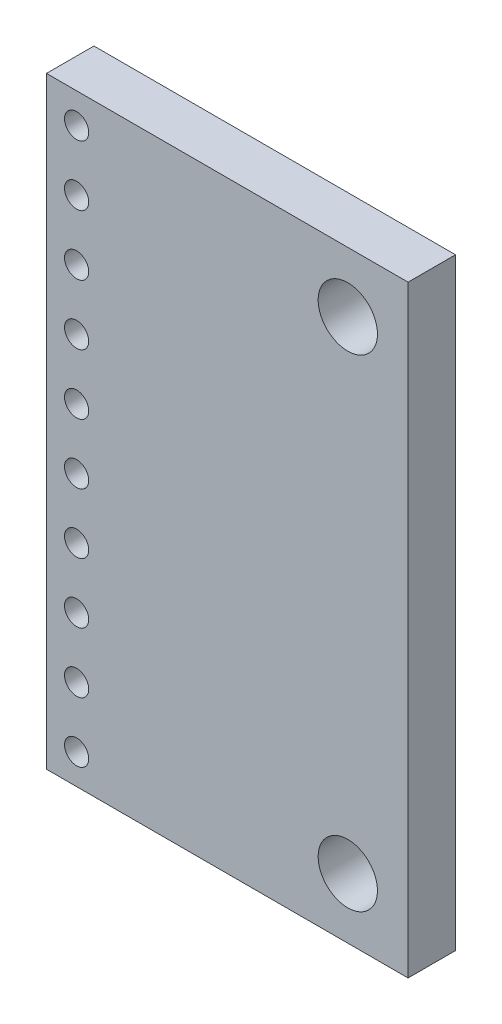
ISO-10303-21;
HEADER;
FILE_DESCRIPTION(('STEP AP214'),'2;1');
FILE_NAME('part.step','',(''),(''),'','','');
FILE_SCHEMA(('AUTOMOTIVE_DESIGN { 1 0 10303 214 1 1 1 1 }'));
ENDSEC;
DATA;
#1=APPLICATION_CONTEXT('core data for automotive mechanical design processes');
#2=APPLICATION_PROTOCOL_DEFINITION('international standard','automotive_design',2000,#1);
#3=PRODUCT_CONTEXT('',#1,'mechanical');
#4=PRODUCT('Part','Part','',(#3));
#5=PRODUCT_RELATED_PRODUCT_CATEGORY('part','',(#4));
#6=PRODUCT_DEFINITION_FORMATION('','',#4);
#7=PRODUCT_DEFINITION_CONTEXT('part definition',#1,'design');
#8=PRODUCT_DEFINITION('design','',#6,#7);
#9=PRODUCT_DEFINITION_SHAPE('','',#8);
#10=(LENGTH_UNIT() NAMED_UNIT(*) SI_UNIT(.MILLI.,.METRE.));
#11=(NAMED_UNIT(*) PLANE_ANGLE_UNIT() SI_UNIT($,.RADIAN.));
#12=(NAMED_UNIT(*) SI_UNIT($,.STERADIAN.) SOLID_ANGLE_UNIT());
#13=UNCERTAINTY_MEASURE_WITH_UNIT(LENGTH_MEASURE(1.E-05),#10,'distance_accuracy_value','');
#14=(GEOMETRIC_REPRESENTATION_CONTEXT(3) GLOBAL_UNCERTAINTY_ASSIGNED_CONTEXT((#13)) GLOBAL_UNIT_ASSIGNED_CONTEXT((#10,
#11,#12)) REPRESENTATION_CONTEXT('',''));
#15=CARTESIAN_POINT('',(0.,0.,0.));
#16=DIRECTION('',(0.,0.,1.));
#17=DIRECTION('',(1.,0.,0.));
#18=AXIS2_PLACEMENT_3D('',#15,#16,#17);
#19=CARTESIAN_POINT('',(0.,0.,2.));
#20=DIRECTION('',(0.,0.,-1.));
#21=DIRECTION('',(-1.,0.,0.));
#22=AXIS2_PLACEMENT_3D('',#19,#20,#21);
#23=PLANE('',#22);
#24=DIRECTION('',(0.,-1.,0.));
#25=VECTOR('',#24,1.);
#26=CARTESIAN_POINT('',(0.,0.,2.));
#27=LINE('',#26,#25);
#28=CARTESIAN_POINT('',(0.,25.4,2.));
#29=VERTEX_POINT('',#28);
#30=CARTESIAN_POINT('',(0.,0.,2.));
#31=VERTEX_POINT('',#30);
#32=EDGE_CURVE('E87',#29,#31,#27,.T.);
#33=ORIENTED_EDGE('',*,*,#32,.T.);
#34=DIRECTION('',(1.,0.,0.));
#35=VECTOR('',#34,1.);
#36=CARTESIAN_POINT('',(0.,0.,2.));
#37=LINE('',#36,#35);
#38=CARTESIAN_POINT('',(15.24,0.,2.));
#39=VERTEX_POINT('',#38);
#40=EDGE_CURVE('E82',#31,#39,#37,.T.);
#41=ORIENTED_EDGE('',*,*,#40,.T.);
#42=DIRECTION('',(0.,1.,0.));
#43=VECTOR('',#42,1.);
#44=CARTESIAN_POINT('',(15.24,0.,2.));
#45=LINE('',#44,#43);
#46=CARTESIAN_POINT('',(15.24,25.4,2.));
#47=VERTEX_POINT('',#46);
#48=EDGE_CURVE('E85',#39,#47,#45,.T.);
#49=ORIENTED_EDGE('',*,*,#48,.T.);
#50=DIRECTION('',(-1.,0.,0.));
#51=VECTOR('',#50,1.);
#52=CARTESIAN_POINT('',(0.,25.4,2.));
#53=LINE('',#52,#51);
#54=EDGE_CURVE('E52',#47,#29,#53,.T.);
#55=ORIENTED_EDGE('',*,*,#54,.T.);
#56=EDGE_LOOP('',(#33,#41,#49,#55));
#57=FACE_BOUND('',#56,.T.);
#58=CARTESIAN_POINT('',(1.27,24.13,2.));
#59=DIRECTION('',(0.,0.,1.));
#60=DIRECTION('',(1.,0.,0.));
#61=AXIS2_PLACEMENT_3D('',#58,#59,#60);
#62=CIRCLE('',#61,0.51);
#63=CARTESIAN_POINT('',(1.78,24.13,2.));
#64=VERTEX_POINT('',#63);
#65=EDGE_CURVE('E102',#64,#64,#62,.T.);
#66=ORIENTED_EDGE('',*,*,#65,.F.);
#67=EDGE_LOOP('',(#66));
#68=FACE_BOUND('',#67,.T.);
#69=CARTESIAN_POINT('',(12.7,22.86,2.));
#70=DIRECTION('',(0.,0.,1.));
#71=DIRECTION('',(1.,0.,0.));
#72=AXIS2_PLACEMENT_3D('',#69,#70,#71);
#73=CIRCLE('',#72,1.25);
#74=CARTESIAN_POINT('',(13.95,22.86,2.));
#75=VERTEX_POINT('',#74);
#76=EDGE_CURVE('E117',#75,#75,#73,.T.);
#77=ORIENTED_EDGE('',*,*,#76,.F.);
#78=EDGE_LOOP('',(#77));
#79=FACE_BOUND('',#78,.T.);
#80=CARTESIAN_POINT('',(1.27000000000003,21.59,2.));
#81=DIRECTION('',(0.,0.,1.));
#82=DIRECTION('',(1.,0.,0.));
#83=AXIS2_PLACEMENT_3D('',#80,#81,#82);
#84=CIRCLE('',#83,0.51);
#85=CARTESIAN_POINT('',(1.78000000000003,21.59,2.));
#86=VERTEX_POINT('',#85);
#87=EDGE_CURVE('E123',#86,#86,#84,.T.);
#88=ORIENTED_EDGE('',*,*,#87,.F.);
#89=EDGE_LOOP('',(#88));
#90=FACE_BOUND('',#89,.T.);
#91=CARTESIAN_POINT('',(1.27000000000005,19.05,2.));
#92=DIRECTION('',(0.,0.,1.));
#93=DIRECTION('',(1.,0.,0.));
#94=AXIS2_PLACEMENT_3D('',#91,#92,#93);
#95=CIRCLE('',#94,0.51);
#96=CARTESIAN_POINT('',(1.78000000000005,19.05,2.));
#97=VERTEX_POINT('',#96);
#98=EDGE_CURVE('E129',#97,#97,#95,.T.);
#99=ORIENTED_EDGE('',*,*,#98,.F.);
#100=EDGE_LOOP('',(#99));
#101=FACE_BOUND('',#100,.T.);
#102=CARTESIAN_POINT('',(1.27000000000008,16.51,2.));
#103=DIRECTION('',(0.,0.,1.));
#104=DIRECTION('',(1.,0.,0.));
#105=AXIS2_PLACEMENT_3D('',#102,#103,#104);
#106=CIRCLE('',#105,0.510000000000001);
#107=CARTESIAN_POINT('',(1.78000000000008,16.51,2.));
#108=VERTEX_POINT('',#107);
#109=EDGE_CURVE('E135',#108,#108,#106,.T.);
#110=ORIENTED_EDGE('',*,*,#109,.F.);
#111=EDGE_LOOP('',(#110));
#112=FACE_BOUND('',#111,.T.);
#113=CARTESIAN_POINT('',(1.27000000000011,13.97,2.));
#114=DIRECTION('',(0.,0.,1.));
#115=DIRECTION('',(1.,0.,0.));
#116=AXIS2_PLACEMENT_3D('',#113,#114,#115);
#117=CIRCLE('',#116,0.51);
#118=CARTESIAN_POINT('',(1.78000000000011,13.97,2.));
#119=VERTEX_POINT('',#118);
#120=EDGE_CURVE('E141',#119,#119,#117,.T.);
#121=ORIENTED_EDGE('',*,*,#120,.F.);
#122=EDGE_LOOP('',(#121));
#123=FACE_BOUND('',#122,.T.);
#124=CARTESIAN_POINT('',(1.27000000000013,11.43,2.));
#125=DIRECTION('',(0.,0.,1.));
#126=DIRECTION('',(1.,0.,0.));
#127=AXIS2_PLACEMENT_3D('',#124,#125,#126);
#128=CIRCLE('',#127,0.51);
#129=CARTESIAN_POINT('',(1.78000000000013,11.43,2.));
#130=VERTEX_POINT('',#129);
#131=EDGE_CURVE('E147',#130,#130,#128,.T.);
#132=ORIENTED_EDGE('',*,*,#131,.F.);
#133=EDGE_LOOP('',(#132));
#134=FACE_BOUND('',#133,.T.);
#135=CARTESIAN_POINT('',(1.27000000000016,8.89,2.));
#136=DIRECTION('',(0.,0.,1.));
#137=DIRECTION('',(1.,0.,0.));
#138=AXIS2_PLACEMENT_3D('',#135,#136,#137);
#139=CIRCLE('',#138,0.51);
#140=CARTESIAN_POINT('',(1.78000000000016,8.89,2.));
#141=VERTEX_POINT('',#140);
#142=EDGE_CURVE('E153',#141,#141,#139,.T.);
#143=ORIENTED_EDGE('',*,*,#142,.F.);
#144=EDGE_LOOP('',(#143));
#145=FACE_BOUND('',#144,.T.);
#146=CARTESIAN_POINT('',(1.27000000000019,6.35,2.));
#147=DIRECTION('',(0.,0.,1.));
#148=DIRECTION('',(1.,0.,0.));
#149=AXIS2_PLACEMENT_3D('',#146,#147,#148);
#150=CIRCLE('',#149,0.51);
#151=CARTESIAN_POINT('',(1.78000000000018,6.35,2.));
#152=VERTEX_POINT('',#151);
#153=EDGE_CURVE('E159',#152,#152,#150,.T.);
#154=ORIENTED_EDGE('',*,*,#153,.F.);
#155=EDGE_LOOP('',(#154));
#156=FACE_BOUND('',#155,.T.);
#157=CARTESIAN_POINT('',(1.27000000000021,3.81,2.));
#158=DIRECTION('',(0.,0.,1.));
#159=DIRECTION('',(1.,0.,0.));
#160=AXIS2_PLACEMENT_3D('',#157,#158,#159);
#161=CIRCLE('',#160,0.51);
#162=CARTESIAN_POINT('',(1.78000000000021,3.81,2.));
#163=VERTEX_POINT('',#162);
#164=EDGE_CURVE('E165',#163,#163,#161,.T.);
#165=ORIENTED_EDGE('',*,*,#164,.F.);
#166=EDGE_LOOP('',(#165));
#167=FACE_BOUND('',#166,.T.);
#168=CARTESIAN_POINT('',(1.27000000000024,1.27,2.));
#169=DIRECTION('',(0.,0.,1.));
#170=DIRECTION('',(1.,0.,0.));
#171=AXIS2_PLACEMENT_3D('',#168,#169,#170);
#172=CIRCLE('',#171,0.51);
#173=CARTESIAN_POINT('',(1.78000000000024,1.27,2.));
#174=VERTEX_POINT('',#173);
#175=EDGE_CURVE('E171',#174,#174,#172,.T.);
#176=ORIENTED_EDGE('',*,*,#175,.F.);
#177=EDGE_LOOP('',(#176));
#178=FACE_BOUND('',#177,.T.);
#179=CARTESIAN_POINT('',(12.7,2.54,2.));
#180=DIRECTION('',(0.,0.,1.));
#181=DIRECTION('',(-1.,0.,0.));
#182=AXIS2_PLACEMENT_3D('',#179,#180,#181);
#183=CIRCLE('',#182,1.25);
#184=CARTESIAN_POINT('',(11.45,2.54,2.));
#185=VERTEX_POINT('',#184);
#186=EDGE_CURVE('E177',#185,#185,#183,.T.);
#187=ORIENTED_EDGE('',*,*,#186,.F.);
#188=EDGE_LOOP('',(#187));
#189=FACE_BOUND('',#188,.T.);
#190=ADVANCED_FACE('F35',(#57,#68,#79,#90,#101,#112,#123,#134,#145,#156,#167,#178,#189),#23,.F.);
#191=CARTESIAN_POINT('',(0.,0.,0.));
#192=DIRECTION('',(0.,0.,-1.));
#193=DIRECTION('',(-1.,0.,0.));
#194=AXIS2_PLACEMENT_3D('',#191,#192,#193);
#195=PLANE('',#194);
#196=CARTESIAN_POINT('',(1.27000000000024,1.27,0.));
#197=DIRECTION('',(0.,0.,1.));
#198=DIRECTION('',(1.,0.,0.));
#199=AXIS2_PLACEMENT_3D('',#196,#197,#198);
#200=CIRCLE('',#199,0.51);
#201=CARTESIAN_POINT('',(1.78000000000024,1.27,0.));
#202=VERTEX_POINT('',#201);
#203=EDGE_CURVE('E174',#202,#202,#200,.T.);
#204=ORIENTED_EDGE('',*,*,#203,.T.);
#205=EDGE_LOOP('',(#204));
#206=FACE_BOUND('',#205,.T.);
#207=CARTESIAN_POINT('',(1.27000000000019,6.35,0.));
#208=DIRECTION('',(0.,0.,1.));
#209=DIRECTION('',(1.,0.,0.));
#210=AXIS2_PLACEMENT_3D('',#207,#208,#209);
#211=CIRCLE('',#210,0.51);
#212=CARTESIAN_POINT('',(1.78000000000018,6.35,0.));
#213=VERTEX_POINT('',#212);
#214=EDGE_CURVE('E162',#213,#213,#211,.T.);
#215=ORIENTED_EDGE('',*,*,#214,.T.);
#216=EDGE_LOOP('',(#215));
#217=FACE_BOUND('',#216,.T.);
#218=CARTESIAN_POINT('',(1.27000000000013,11.43,0.));
#219=DIRECTION('',(0.,0.,1.));
#220=DIRECTION('',(1.,0.,0.));
#221=AXIS2_PLACEMENT_3D('',#218,#219,#220);
#222=CIRCLE('',#221,0.51);
#223=CARTESIAN_POINT('',(1.78000000000013,11.43,0.));
#224=VERTEX_POINT('',#223);
#225=EDGE_CURVE('E150',#224,#224,#222,.T.);
#226=ORIENTED_EDGE('',*,*,#225,.T.);
#227=EDGE_LOOP('',(#226));
#228=FACE_BOUND('',#227,.T.);
#229=CARTESIAN_POINT('',(1.27000000000008,16.51,0.));
#230=DIRECTION('',(0.,0.,1.));
#231=DIRECTION('',(1.,0.,0.));
#232=AXIS2_PLACEMENT_3D('',#229,#230,#231);
#233=CIRCLE('',#232,0.510000000000001);
#234=CARTESIAN_POINT('',(1.78000000000008,16.51,0.));
#235=VERTEX_POINT('',#234);
#236=EDGE_CURVE('E138',#235,#235,#233,.T.);
#237=ORIENTED_EDGE('',*,*,#236,.T.);
#238=EDGE_LOOP('',(#237));
#239=FACE_BOUND('',#238,.T.);
#240=CARTESIAN_POINT('',(1.27000000000003,21.59,0.));
#241=DIRECTION('',(0.,0.,1.));
#242=DIRECTION('',(1.,0.,0.));
#243=AXIS2_PLACEMENT_3D('',#240,#241,#242);
#244=CIRCLE('',#243,0.51);
#245=CARTESIAN_POINT('',(1.78000000000003,21.59,0.));
#246=VERTEX_POINT('',#245);
#247=EDGE_CURVE('E126',#246,#246,#244,.T.);
#248=ORIENTED_EDGE('',*,*,#247,.T.);
#249=EDGE_LOOP('',(#248));
#250=FACE_BOUND('',#249,.T.);
#251=CARTESIAN_POINT('',(1.27,24.13,0.));
#252=DIRECTION('',(0.,0.,1.));
#253=DIRECTION('',(1.,0.,0.));
#254=AXIS2_PLACEMENT_3D('',#251,#252,#253);
#255=CIRCLE('',#254,0.51);
#256=CARTESIAN_POINT('',(1.78,24.13,0.));
#257=VERTEX_POINT('',#256);
#258=EDGE_CURVE('E114',#257,#257,#255,.T.);
#259=ORIENTED_EDGE('',*,*,#258,.T.);
#260=EDGE_LOOP('',(#259));
#261=FACE_BOUND('',#260,.T.);
#262=DIRECTION('',(0.,-1.,0.));
#263=VECTOR('',#262,1.);
#264=CARTESIAN_POINT('',(0.,0.,0.));
#265=LINE('',#264,#263);
#266=CARTESIAN_POINT('',(0.,25.4,0.));
#267=VERTEX_POINT('',#266);
#268=CARTESIAN_POINT('',(0.,0.,0.));
#269=VERTEX_POINT('',#268);
#270=EDGE_CURVE('E99',#267,#269,#265,.T.);
#271=ORIENTED_EDGE('',*,*,#270,.F.);
#272=DIRECTION('',(-1.,0.,0.));
#273=VECTOR('',#272,1.);
#274=CARTESIAN_POINT('',(0.,25.4,0.));
#275=LINE('',#274,#273);
#276=CARTESIAN_POINT('',(15.24,25.4,0.));
#277=VERTEX_POINT('',#276);
#278=EDGE_CURVE('E75',#277,#267,#275,.T.);
#279=ORIENTED_EDGE('',*,*,#278,.F.);
#280=DIRECTION('',(0.,1.,0.));
#281=VECTOR('',#280,1.);
#282=CARTESIAN_POINT('',(15.24,0.,0.));
#283=LINE('',#282,#281);
#284=CARTESIAN_POINT('',(15.24,0.,0.));
#285=VERTEX_POINT('',#284);
#286=EDGE_CURVE('E69',#285,#277,#283,.T.);
#287=ORIENTED_EDGE('',*,*,#286,.F.);
#288=DIRECTION('',(1.,0.,0.));
#289=VECTOR('',#288,1.);
#290=CARTESIAN_POINT('',(0.,0.,0.));
#291=LINE('',#290,#289);
#292=EDGE_CURVE('E91',#269,#285,#291,.T.);
#293=ORIENTED_EDGE('',*,*,#292,.F.);
#294=EDGE_LOOP('',(#271,#279,#287,#293));
#295=FACE_BOUND('',#294,.T.);
#296=CARTESIAN_POINT('',(12.7,22.86,0.));
#297=DIRECTION('',(0.,0.,1.));
#298=DIRECTION('',(1.,0.,0.));
#299=AXIS2_PLACEMENT_3D('',#296,#297,#298);
#300=CIRCLE('',#299,1.25);
#301=CARTESIAN_POINT('',(13.95,22.86,0.));
#302=VERTEX_POINT('',#301);
#303=EDGE_CURVE('E120',#302,#302,#300,.T.);
#304=ORIENTED_EDGE('',*,*,#303,.T.);
#305=EDGE_LOOP('',(#304));
#306=FACE_BOUND('',#305,.T.);
#307=CARTESIAN_POINT('',(1.27000000000005,19.05,0.));
#308=DIRECTION('',(0.,0.,1.));
#309=DIRECTION('',(1.,0.,0.));
#310=AXIS2_PLACEMENT_3D('',#307,#308,#309);
#311=CIRCLE('',#310,0.51);
#312=CARTESIAN_POINT('',(1.78000000000005,19.05,0.));
#313=VERTEX_POINT('',#312);
#314=EDGE_CURVE('E132',#313,#313,#311,.T.);
#315=ORIENTED_EDGE('',*,*,#314,.T.);
#316=EDGE_LOOP('',(#315));
#317=FACE_BOUND('',#316,.T.);
#318=CARTESIAN_POINT('',(1.27000000000011,13.97,0.));
#319=DIRECTION('',(0.,0.,1.));
#320=DIRECTION('',(1.,0.,0.));
#321=AXIS2_PLACEMENT_3D('',#318,#319,#320);
#322=CIRCLE('',#321,0.51);
#323=CARTESIAN_POINT('',(1.78000000000011,13.97,0.));
#324=VERTEX_POINT('',#323);
#325=EDGE_CURVE('E144',#324,#324,#322,.T.);
#326=ORIENTED_EDGE('',*,*,#325,.T.);
#327=EDGE_LOOP('',(#326));
#328=FACE_BOUND('',#327,.T.);
#329=CARTESIAN_POINT('',(1.27000000000016,8.89,0.));
#330=DIRECTION('',(0.,0.,1.));
#331=DIRECTION('',(1.,0.,0.));
#332=AXIS2_PLACEMENT_3D('',#329,#330,#331);
#333=CIRCLE('',#332,0.51);
#334=CARTESIAN_POINT('',(1.78000000000016,8.89,0.));
#335=VERTEX_POINT('',#334);
#336=EDGE_CURVE('E156',#335,#335,#333,.T.);
#337=ORIENTED_EDGE('',*,*,#336,.T.);
#338=EDGE_LOOP('',(#337));
#339=FACE_BOUND('',#338,.T.);
#340=CARTESIAN_POINT('',(1.27000000000021,3.81,0.));
#341=DIRECTION('',(0.,0.,1.));
#342=DIRECTION('',(1.,0.,0.));
#343=AXIS2_PLACEMENT_3D('',#340,#341,#342);
#344=CIRCLE('',#343,0.51);
#345=CARTESIAN_POINT('',(1.78000000000021,3.81,0.));
#346=VERTEX_POINT('',#345);
#347=EDGE_CURVE('E168',#346,#346,#344,.T.);
#348=ORIENTED_EDGE('',*,*,#347,.T.);
#349=EDGE_LOOP('',(#348));
#350=FACE_BOUND('',#349,.T.);
#351=CARTESIAN_POINT('',(12.7,2.54,0.));
#352=DIRECTION('',(0.,0.,1.));
#353=DIRECTION('',(-1.,0.,0.));
#354=AXIS2_PLACEMENT_3D('',#351,#352,#353);
#355=CIRCLE('',#354,1.25);
#356=CARTESIAN_POINT('',(11.45,2.54,0.));
#357=VERTEX_POINT('',#356);
#358=EDGE_CURVE('E180',#357,#357,#355,.T.);
#359=ORIENTED_EDGE('',*,*,#358,.T.);
#360=EDGE_LOOP('',(#359));
#361=FACE_BOUND('',#360,.T.);
#362=ADVANCED_FACE('F110',(#206,#217,#228,#239,#250,#261,#295,#306,#317,#328,#339,#350,#361),
#195,.T.);
#363=CARTESIAN_POINT('',(0.,0.,2.));
#364=DIRECTION('',(1.,0.,0.));
#365=DIRECTION('',(0.,0.,-1.));
#366=AXIS2_PLACEMENT_3D('',#363,#364,#365);
#367=PLANE('',#366);
#368=ORIENTED_EDGE('',*,*,#270,.T.);
#369=DIRECTION('',(0.,0.,-1.));
#370=VECTOR('',#369,1.);
#371=CARTESIAN_POINT('',(0.,0.,2.));
#372=LINE('',#371,#370);
#373=EDGE_CURVE('E11',#31,#269,#372,.T.);
#374=ORIENTED_EDGE('',*,*,#373,.F.);
#375=ORIENTED_EDGE('',*,*,#32,.F.);
#376=DIRECTION('',(0.,0.,-1.));
#377=VECTOR('',#376,1.);
#378=CARTESIAN_POINT('',(0.,25.4,2.));
#379=LINE('',#378,#377);
#380=EDGE_CURVE('E95',#29,#267,#379,.T.);
#381=ORIENTED_EDGE('',*,*,#380,.T.);
#382=EDGE_LOOP('',(#368,#374,#375,#381));
#383=FACE_BOUND('',#382,.T.);
#384=ADVANCED_FACE('F37',(#383),#367,.F.);
#385=CARTESIAN_POINT('',(0.,0.,2.));
#386=DIRECTION('',(0.,1.,0.));
#387=DIRECTION('',(0.,0.,1.));
#388=AXIS2_PLACEMENT_3D('',#385,#386,#387);
#389=PLANE('',#388);
#390=ORIENTED_EDGE('',*,*,#292,.T.);
#391=DIRECTION('',(0.,0.,-1.));
#392=VECTOR('',#391,1.);
#393=CARTESIAN_POINT('',(15.24,0.,2.));
#394=LINE('',#393,#392);
#395=EDGE_CURVE('E44',#39,#285,#394,.T.);
#396=ORIENTED_EDGE('',*,*,#395,.F.);
#397=ORIENTED_EDGE('',*,*,#40,.F.);
#398=ORIENTED_EDGE('',*,*,#373,.T.);
#399=EDGE_LOOP('',(#390,#396,#397,#398));
#400=FACE_BOUND('',#399,.T.);
#401=ADVANCED_FACE('F90',(#400),#389,.F.);
#402=CARTESIAN_POINT('',(15.24,0.,2.));
#403=DIRECTION('',(-1.,0.,0.));
#404=DIRECTION('',(0.,0.,1.));
#405=AXIS2_PLACEMENT_3D('',#402,#403,#404);
#406=PLANE('',#405);
#407=ORIENTED_EDGE('',*,*,#286,.T.);
#408=DIRECTION('',(0.,0.,-1.));
#409=VECTOR('',#408,1.);
#410=CARTESIAN_POINT('',(15.24,25.4,2.));
#411=LINE('',#410,#409);
#412=EDGE_CURVE('E92',#47,#277,#411,.T.);
#413=ORIENTED_EDGE('',*,*,#412,.F.);
#414=ORIENTED_EDGE('',*,*,#48,.F.);
#415=ORIENTED_EDGE('',*,*,#395,.T.);
#416=EDGE_LOOP('',(#407,#413,#414,#415));
#417=FACE_BOUND('',#416,.T.);
#418=ADVANCED_FACE('F93',(#417),#406,.F.);
#419=CARTESIAN_POINT('',(0.,25.4,2.));
#420=DIRECTION('',(0.,-1.,0.));
#421=DIRECTION('',(0.,0.,-1.));
#422=AXIS2_PLACEMENT_3D('',#419,#420,#421);
#423=PLANE('',#422);
#424=ORIENTED_EDGE('',*,*,#278,.T.);
#425=ORIENTED_EDGE('',*,*,#380,.F.);
#426=ORIENTED_EDGE('',*,*,#54,.F.);
#427=ORIENTED_EDGE('',*,*,#412,.T.);
#428=EDGE_LOOP('',(#424,#425,#426,#427));
#429=FACE_BOUND('',#428,.T.);
#430=ADVANCED_FACE('F107',(#429),#423,.F.);
#431=CARTESIAN_POINT('',(1.27,24.13,2.));
#432=DIRECTION('',(0.,0.,-1.));
#433=DIRECTION('',(-1.,0.,0.));
#434=AXIS2_PLACEMENT_3D('',#431,#432,#433);
#435=CYLINDRICAL_SURFACE('',#434,0.51);
#436=ORIENTED_EDGE('',*,*,#65,.T.);
#437=EDGE_LOOP('',(#436));
#438=FACE_BOUND('',#437,.T.);
#439=ORIENTED_EDGE('',*,*,#258,.F.);
#440=EDGE_LOOP('',(#439));
#441=FACE_BOUND('',#440,.T.);
#442=ADVANCED_FACE('F197',(#438,#441),#435,.F.);
#443=CARTESIAN_POINT('',(12.7,22.86,2.));
#444=DIRECTION('',(0.,0.,-1.));
#445=DIRECTION('',(-1.,0.,0.));
#446=AXIS2_PLACEMENT_3D('',#443,#444,#445);
#447=CYLINDRICAL_SURFACE('',#446,1.25);
#448=ORIENTED_EDGE('',*,*,#76,.T.);
#449=EDGE_LOOP('',(#448));
#450=FACE_BOUND('',#449,.T.);
#451=ORIENTED_EDGE('',*,*,#303,.F.);
#452=EDGE_LOOP('',(#451));
#453=FACE_BOUND('',#452,.T.);
#454=ADVANCED_FACE('F243',(#450,#453),#447,.F.);
#455=CARTESIAN_POINT('',(1.27000000000003,21.59,2.));
#456=DIRECTION('',(0.,0.,-1.));
#457=DIRECTION('',(-1.,0.,0.));
#458=AXIS2_PLACEMENT_3D('',#455,#456,#457);
#459=CYLINDRICAL_SURFACE('',#458,0.51);
#460=ORIENTED_EDGE('',*,*,#87,.T.);
#461=EDGE_LOOP('',(#460));
#462=FACE_BOUND('',#461,.T.);
#463=ORIENTED_EDGE('',*,*,#247,.F.);
#464=EDGE_LOOP('',(#463));
#465=FACE_BOUND('',#464,.T.);
#466=ADVANCED_FACE('F251',(#462,#465),#459,.F.);
#467=CARTESIAN_POINT('',(1.27000000000005,19.05,2.));
#468=DIRECTION('',(0.,0.,-1.));
#469=DIRECTION('',(-1.,0.,0.));
#470=AXIS2_PLACEMENT_3D('',#467,#468,#469);
#471=CYLINDRICAL_SURFACE('',#470,0.51);
#472=ORIENTED_EDGE('',*,*,#98,.T.);
#473=EDGE_LOOP('',(#472));
#474=FACE_BOUND('',#473,.T.);
#475=ORIENTED_EDGE('',*,*,#314,.F.);
#476=EDGE_LOOP('',(#475));
#477=FACE_BOUND('',#476,.T.);
#478=ADVANCED_FACE('F259',(#474,#477),#471,.F.);
#479=CARTESIAN_POINT('',(1.27000000000008,16.51,2.));
#480=DIRECTION('',(0.,0.,-1.));
#481=DIRECTION('',(-1.,0.,0.));
#482=AXIS2_PLACEMENT_3D('',#479,#480,#481);
#483=CYLINDRICAL_SURFACE('',#482,0.510000000000001);
#484=ORIENTED_EDGE('',*,*,#109,.T.);
#485=EDGE_LOOP('',(#484));
#486=FACE_BOUND('',#485,.T.);
#487=ORIENTED_EDGE('',*,*,#236,.F.);
#488=EDGE_LOOP('',(#487));
#489=FACE_BOUND('',#488,.T.);
#490=ADVANCED_FACE('F268',(#486,#489),#483,.F.);
#491=CARTESIAN_POINT('',(1.27000000000011,13.97,2.));
#492=DIRECTION('',(0.,0.,-1.));
#493=DIRECTION('',(-1.,0.,0.));
#494=AXIS2_PLACEMENT_3D('',#491,#492,#493);
#495=CYLINDRICAL_SURFACE('',#494,0.51);
#496=ORIENTED_EDGE('',*,*,#120,.T.);
#497=EDGE_LOOP('',(#496));
#498=FACE_BOUND('',#497,.T.);
#499=ORIENTED_EDGE('',*,*,#325,.F.);
#500=EDGE_LOOP('',(#499));
#501=FACE_BOUND('',#500,.T.);
#502=ADVANCED_FACE('F277',(#498,#501),#495,.F.);
#503=CARTESIAN_POINT('',(1.27000000000013,11.43,2.));
#504=DIRECTION('',(0.,0.,-1.));
#505=DIRECTION('',(-1.,0.,0.));
#506=AXIS2_PLACEMENT_3D('',#503,#504,#505);
#507=CYLINDRICAL_SURFACE('',#506,0.51);
#508=ORIENTED_EDGE('',*,*,#131,.T.);
#509=EDGE_LOOP('',(#508));
#510=FACE_BOUND('',#509,.T.);
#511=ORIENTED_EDGE('',*,*,#225,.F.);
#512=EDGE_LOOP('',(#511));
#513=FACE_BOUND('',#512,.T.);
#514=ADVANCED_FACE('F286',(#510,#513),#507,.F.);
#515=CARTESIAN_POINT('',(1.27000000000016,8.89,2.));
#516=DIRECTION('',(0.,0.,-1.));
#517=DIRECTION('',(-1.,0.,0.));
#518=AXIS2_PLACEMENT_3D('',#515,#516,#517);
#519=CYLINDRICAL_SURFACE('',#518,0.51);
#520=ORIENTED_EDGE('',*,*,#142,.T.);
#521=EDGE_LOOP('',(#520));
#522=FACE_BOUND('',#521,.T.);
#523=ORIENTED_EDGE('',*,*,#336,.F.);
#524=EDGE_LOOP('',(#523));
#525=FACE_BOUND('',#524,.T.);
#526=ADVANCED_FACE('F295',(#522,#525),#519,.F.);
#527=CARTESIAN_POINT('',(1.27000000000019,6.35,2.));
#528=DIRECTION('',(0.,0.,-1.));
#529=DIRECTION('',(-1.,0.,0.));
#530=AXIS2_PLACEMENT_3D('',#527,#528,#529);
#531=CYLINDRICAL_SURFACE('',#530,0.51);
#532=ORIENTED_EDGE('',*,*,#153,.T.);
#533=EDGE_LOOP('',(#532));
#534=FACE_BOUND('',#533,.T.);
#535=ORIENTED_EDGE('',*,*,#214,.F.);
#536=EDGE_LOOP('',(#535));
#537=FACE_BOUND('',#536,.T.);
#538=ADVANCED_FACE('F304',(#534,#537),#531,.F.);
#539=CARTESIAN_POINT('',(1.27000000000021,3.81,2.));
#540=DIRECTION('',(0.,0.,-1.));
#541=DIRECTION('',(-1.,0.,0.));
#542=AXIS2_PLACEMENT_3D('',#539,#540,#541);
#543=CYLINDRICAL_SURFACE('',#542,0.51);
#544=ORIENTED_EDGE('',*,*,#164,.T.);
#545=EDGE_LOOP('',(#544));
#546=FACE_BOUND('',#545,.T.);
#547=ORIENTED_EDGE('',*,*,#347,.F.);
#548=EDGE_LOOP('',(#547));
#549=FACE_BOUND('',#548,.T.);
#550=ADVANCED_FACE('F313',(#546,#549),#543,.F.);
#551=CARTESIAN_POINT('',(1.27000000000024,1.27,2.));
#552=DIRECTION('',(0.,0.,-1.));
#553=DIRECTION('',(-1.,0.,0.));
#554=AXIS2_PLACEMENT_3D('',#551,#552,#553);
#555=CYLINDRICAL_SURFACE('',#554,0.51);
#556=ORIENTED_EDGE('',*,*,#175,.T.);
#557=EDGE_LOOP('',(#556));
#558=FACE_BOUND('',#557,.T.);
#559=ORIENTED_EDGE('',*,*,#203,.F.);
#560=EDGE_LOOP('',(#559));
#561=FACE_BOUND('',#560,.T.);
#562=ADVANCED_FACE('F322',(#558,#561),#555,.F.);
#563=CARTESIAN_POINT('',(12.7,2.54,2.));
#564=DIRECTION('',(0.,0.,-1.));
#565=DIRECTION('',(-1.,0.,0.));
#566=AXIS2_PLACEMENT_3D('',#563,#564,#565);
#567=CYLINDRICAL_SURFACE('',#566,1.25);
#568=ORIENTED_EDGE('',*,*,#186,.T.);
#569=EDGE_LOOP('',(#568));
#570=FACE_BOUND('',#569,.T.);
#571=ORIENTED_EDGE('',*,*,#358,.F.);
#572=EDGE_LOOP('',(#571));
#573=FACE_BOUND('',#572,.T.);
#574=ADVANCED_FACE('F186',(#570,#573),#567,.F.);
#575=CLOSED_SHELL('',(#190,#362,#384,#401,#418,#430,#442,#454,#466,#478,#490,#502,#514,#526,
#538,#550,#562,#574));
#576=MANIFOLD_SOLID_BREP('B2',#575);
#577=ADVANCED_BREP_SHAPE_REPRESENTATION('',(#18,#576),#14);
#578=SHAPE_DEFINITION_REPRESENTATION(#9,#577);
ENDSEC;
END-ISO-10303-21;
